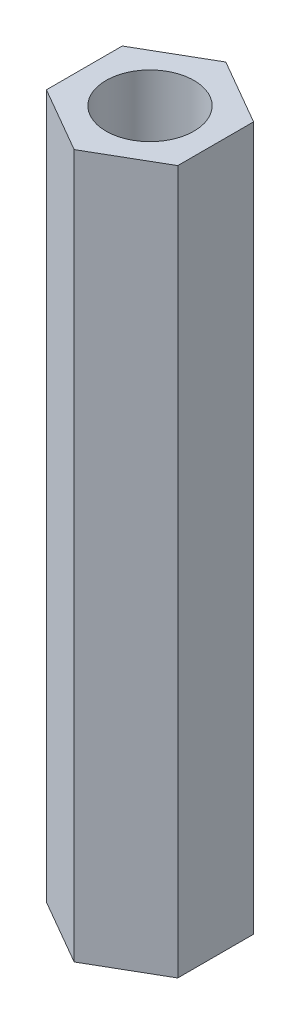
ISO-10303-21;
HEADER;
FILE_DESCRIPTION(('STEP AP214'),'2;1');
FILE_NAME('part.step','',(''),(''),'','','');
FILE_SCHEMA(('AUTOMOTIVE_DESIGN { 1 0 10303 214 1 1 1 1 }'));
ENDSEC;
DATA;
#1=APPLICATION_CONTEXT('core data for automotive mechanical design processes');
#2=APPLICATION_PROTOCOL_DEFINITION('international standard','automotive_design',2000,#1);
#3=PRODUCT_CONTEXT('',#1,'mechanical');
#4=PRODUCT('Part','Part','',(#3));
#5=PRODUCT_RELATED_PRODUCT_CATEGORY('part','',(#4));
#6=PRODUCT_DEFINITION_FORMATION('','',#4);
#7=PRODUCT_DEFINITION_CONTEXT('part definition',#1,'design');
#8=PRODUCT_DEFINITION('design','',#6,#7);
#9=PRODUCT_DEFINITION_SHAPE('','',#8);
#10=(LENGTH_UNIT() NAMED_UNIT(*) SI_UNIT(.MILLI.,.METRE.));
#11=(NAMED_UNIT(*) PLANE_ANGLE_UNIT() SI_UNIT($,.RADIAN.));
#12=(NAMED_UNIT(*) SI_UNIT($,.STERADIAN.) SOLID_ANGLE_UNIT());
#13=UNCERTAINTY_MEASURE_WITH_UNIT(LENGTH_MEASURE(1.E-05),#10,'distance_accuracy_value','');
#14=(GEOMETRIC_REPRESENTATION_CONTEXT(3) GLOBAL_UNCERTAINTY_ASSIGNED_CONTEXT((#13)) GLOBAL_UNIT_ASSIGNED_CONTEXT((#10,
#11,#12)) REPRESENTATION_CONTEXT('',''));
#15=CARTESIAN_POINT('',(0.,0.,0.));
#16=DIRECTION('',(0.,0.,1.));
#17=DIRECTION('',(1.,0.,0.));
#18=AXIS2_PLACEMENT_3D('',#15,#16,#17);
#19=CARTESIAN_POINT('',(0.,19.05,0.));
#20=DIRECTION('',(0.,1.,0.));
#21=DIRECTION('',(0.,0.,1.));
#22=AXIS2_PLACEMENT_3D('',#19,#20,#21);
#23=PLANE('',#22);
#24=DIRECTION('',(0.866025403784438,0.,0.5));
#25=VECTOR('',#24,1.);
#26=CARTESIAN_POINT('',(-1.778,19.05,1.02652877861915));
#27=LINE('',#26,#25);
#28=CARTESIAN_POINT('',(-1.778,19.05,1.02652877861915));
#29=VERTEX_POINT('',#28);
#30=CARTESIAN_POINT('',(0.,19.05,2.05305755723831));
#31=VERTEX_POINT('',#30);
#32=EDGE_CURVE('E128',#29,#31,#27,.T.);
#33=ORIENTED_EDGE('',*,*,#32,.T.);
#34=DIRECTION('',(0.866025403784439,0.,-0.5));
#35=VECTOR('',#34,1.);
#36=CARTESIAN_POINT('',(0.,19.05,2.05305755723831));
#37=LINE('',#36,#35);
#38=CARTESIAN_POINT('',(1.778,19.05,1.02652877861915));
#39=VERTEX_POINT('',#38);
#40=EDGE_CURVE('E86',#31,#39,#37,.T.);
#41=ORIENTED_EDGE('',*,*,#40,.T.);
#42=DIRECTION('',(0.,0.,-1.));
#43=VECTOR('',#42,1.);
#44=CARTESIAN_POINT('',(1.778,19.05,1.02652877861915));
#45=LINE('',#44,#43);
#46=CARTESIAN_POINT('',(1.778,19.05,-1.02652877861915));
#47=VERTEX_POINT('',#46);
#48=EDGE_CURVE('E99',#39,#47,#45,.T.);
#49=ORIENTED_EDGE('',*,*,#48,.T.);
#50=DIRECTION('',(-0.866025403784439,0.,-0.5));
#51=VECTOR('',#50,1.);
#52=CARTESIAN_POINT('',(1.778,19.05,-1.02652877861915));
#53=LINE('',#52,#51);
#54=CARTESIAN_POINT('',(0.,19.05,-2.05305755723831));
#55=VERTEX_POINT('',#54);
#56=EDGE_CURVE('E93',#47,#55,#53,.T.);
#57=ORIENTED_EDGE('',*,*,#56,.T.);
#58=DIRECTION('',(-0.866025403784439,0.,0.5));
#59=VECTOR('',#58,1.);
#60=CARTESIAN_POINT('',(0.,19.05,-2.05305755723831));
#61=LINE('',#60,#59);
#62=CARTESIAN_POINT('',(-1.778,19.05,-1.02652877861915));
#63=VERTEX_POINT('',#62);
#64=EDGE_CURVE('E97',#55,#63,#61,.T.);
#65=ORIENTED_EDGE('',*,*,#64,.T.);
#66=DIRECTION('',(0.,0.,1.));
#67=VECTOR('',#66,1.);
#68=CARTESIAN_POINT('',(-1.778,19.05,-1.02652877861915));
#69=LINE('',#68,#67);
#70=EDGE_CURVE('E49',#63,#29,#69,.T.);
#71=ORIENTED_EDGE('',*,*,#70,.T.);
#72=EDGE_LOOP('',(#33,#41,#49,#57,#65,#71));
#73=FACE_BOUND('',#72,.T.);
#74=CARTESIAN_POINT('',(0.,19.05,0.));
#75=DIRECTION('',(0.,1.,0.));
#76=DIRECTION('',(0.,0.,1.));
#77=AXIS2_PLACEMENT_3D('',#74,#75,#76);
#78=CIRCLE('',#77,1.190625);
#79=CARTESIAN_POINT('',(0.,19.05,1.190625));
#80=VERTEX_POINT('',#79);
#81=EDGE_CURVE('E121',#80,#80,#78,.T.);
#82=ORIENTED_EDGE('',*,*,#81,.F.);
#83=EDGE_LOOP('',(#82));
#84=FACE_BOUND('',#83,.T.);
#85=ADVANCED_FACE('F32',(#73,#84),#23,.T.);
#86=CARTESIAN_POINT('',(0.,0.,0.));
#87=DIRECTION('',(0.,1.,0.));
#88=DIRECTION('',(0.,0.,1.));
#89=AXIS2_PLACEMENT_3D('',#86,#87,#88);
#90=PLANE('',#89);
#91=DIRECTION('',(0.866025403784438,0.,0.5));
#92=VECTOR('',#91,1.);
#93=CARTESIAN_POINT('',(-1.778,0.,1.02652877861915));
#94=LINE('',#93,#92);
#95=CARTESIAN_POINT('',(-1.778,0.,1.02652877861915));
#96=VERTEX_POINT('',#95);
#97=CARTESIAN_POINT('',(0.,0.,2.05305755723831));
#98=VERTEX_POINT('',#97);
#99=EDGE_CURVE('E117',#96,#98,#94,.T.);
#100=ORIENTED_EDGE('',*,*,#99,.F.);
#101=DIRECTION('',(0.,0.,1.));
#102=VECTOR('',#101,1.);
#103=CARTESIAN_POINT('',(-1.778,0.,-1.02652877861915));
#104=LINE('',#103,#102);
#105=CARTESIAN_POINT('',(-1.778,0.,-1.02652877861915));
#106=VERTEX_POINT('',#105);
#107=EDGE_CURVE('E78',#106,#96,#104,.T.);
#108=ORIENTED_EDGE('',*,*,#107,.F.);
#109=DIRECTION('',(-0.866025403784439,0.,0.5));
#110=VECTOR('',#109,1.);
#111=CARTESIAN_POINT('',(0.,0.,-2.05305755723831));
#112=LINE('',#111,#110);
#113=CARTESIAN_POINT('',(0.,0.,-2.05305755723831));
#114=VERTEX_POINT('',#113);
#115=EDGE_CURVE('E72',#114,#106,#112,.T.);
#116=ORIENTED_EDGE('',*,*,#115,.F.);
#117=DIRECTION('',(-0.866025403784439,0.,-0.5));
#118=VECTOR('',#117,1.);
#119=CARTESIAN_POINT('',(1.778,0.,-1.02652877861915));
#120=LINE('',#119,#118);
#121=CARTESIAN_POINT('',(1.778,0.,-1.02652877861915));
#122=VERTEX_POINT('',#121);
#123=EDGE_CURVE('E107',#122,#114,#120,.T.);
#124=ORIENTED_EDGE('',*,*,#123,.F.);
#125=DIRECTION('',(0.,0.,-1.));
#126=VECTOR('',#125,1.);
#127=CARTESIAN_POINT('',(1.778,0.,1.02652877861915));
#128=LINE('',#127,#126);
#129=CARTESIAN_POINT('',(1.778,0.,1.02652877861915));
#130=VERTEX_POINT('',#129);
#131=EDGE_CURVE('E123',#130,#122,#128,.T.);
#132=ORIENTED_EDGE('',*,*,#131,.F.);
#133=DIRECTION('',(0.866025403784439,0.,-0.5));
#134=VECTOR('',#133,1.);
#135=CARTESIAN_POINT('',(0.,0.,2.05305755723831));
#136=LINE('',#135,#134);
#137=EDGE_CURVE('E120',#98,#130,#136,.T.);
#138=ORIENTED_EDGE('',*,*,#137,.F.);
#139=EDGE_LOOP('',(#100,#108,#116,#124,#132,#138));
#140=FACE_BOUND('',#139,.T.);
#141=CARTESIAN_POINT('',(0.,0.,0.));
#142=DIRECTION('',(0.,1.,0.));
#143=DIRECTION('',(0.,0.,1.));
#144=AXIS2_PLACEMENT_3D('',#141,#142,#143);
#145=CIRCLE('',#144,1.190625);
#146=CARTESIAN_POINT('',(0.,0.,1.190625));
#147=VERTEX_POINT('',#146);
#148=EDGE_CURVE('E221',#147,#147,#145,.T.);
#149=ORIENTED_EDGE('',*,*,#148,.T.);
#150=EDGE_LOOP('',(#149));
#151=FACE_BOUND('',#150,.T.);
#152=ADVANCED_FACE('F137',(#140,#151),#90,.F.);
#153=CARTESIAN_POINT('',(-1.778,19.05,1.02652877861915));
#154=DIRECTION('',(0.5,0.,-0.866025403784439));
#155=DIRECTION('',(-0.866025403784438,0.,-0.5));
#156=AXIS2_PLACEMENT_3D('',#153,#154,#155);
#157=PLANE('',#156);
#158=ORIENTED_EDGE('',*,*,#99,.T.);
#159=DIRECTION('',(0.,-1.,0.));
#160=VECTOR('',#159,1.);
#161=CARTESIAN_POINT('',(0.,19.05,2.05305755723831));
#162=LINE('',#161,#160);
#163=EDGE_CURVE('E11',#31,#98,#162,.T.);
#164=ORIENTED_EDGE('',*,*,#163,.F.);
#165=ORIENTED_EDGE('',*,*,#32,.F.);
#166=DIRECTION('',(0.,-1.,0.));
#167=VECTOR('',#166,1.);
#168=CARTESIAN_POINT('',(-1.778,19.05,1.02652877861915));
#169=LINE('',#168,#167);
#170=EDGE_CURVE('E113',#29,#96,#169,.T.);
#171=ORIENTED_EDGE('',*,*,#170,.T.);
#172=EDGE_LOOP('',(#158,#164,#165,#171));
#173=FACE_BOUND('',#172,.T.);
#174=ADVANCED_FACE('F34',(#173),#157,.F.);
#175=CARTESIAN_POINT('',(0.,19.05,2.05305755723831));
#176=DIRECTION('',(-0.5,0.,-0.866025403784439));
#177=DIRECTION('',(-0.866025403784439,0.,0.5));
#178=AXIS2_PLACEMENT_3D('',#175,#176,#177);
#179=PLANE('',#178);
#180=ORIENTED_EDGE('',*,*,#137,.T.);
#181=DIRECTION('',(0.,-1.,0.));
#182=VECTOR('',#181,1.);
#183=CARTESIAN_POINT('',(1.778,19.05,1.02652877861915));
#184=LINE('',#183,#182);
#185=EDGE_CURVE('E41',#39,#130,#184,.T.);
#186=ORIENTED_EDGE('',*,*,#185,.F.);
#187=ORIENTED_EDGE('',*,*,#40,.F.);
#188=ORIENTED_EDGE('',*,*,#163,.T.);
#189=EDGE_LOOP('',(#180,#186,#187,#188));
#190=FACE_BOUND('',#189,.T.);
#191=ADVANCED_FACE('F162',(#190),#179,.F.);
#192=CARTESIAN_POINT('',(1.778,19.05,1.02652877861915));
#193=DIRECTION('',(-1.,0.,0.));
#194=DIRECTION('',(0.,0.,1.));
#195=AXIS2_PLACEMENT_3D('',#192,#193,#194);
#196=PLANE('',#195);
#197=ORIENTED_EDGE('',*,*,#131,.T.);
#198=DIRECTION('',(0.,-1.,0.));
#199=VECTOR('',#198,1.);
#200=CARTESIAN_POINT('',(1.778,19.05,-1.02652877861915));
#201=LINE('',#200,#199);
#202=EDGE_CURVE('E108',#47,#122,#201,.T.);
#203=ORIENTED_EDGE('',*,*,#202,.F.);
#204=ORIENTED_EDGE('',*,*,#48,.F.);
#205=ORIENTED_EDGE('',*,*,#185,.T.);
#206=EDGE_LOOP('',(#197,#203,#204,#205));
#207=FACE_BOUND('',#206,.T.);
#208=ADVANCED_FACE('F134',(#207),#196,.F.);
#209=CARTESIAN_POINT('',(1.778,19.05,-1.02652877861915));
#210=DIRECTION('',(-0.5,0.,0.866025403784439));
#211=DIRECTION('',(0.866025403784438,0.,0.5));
#212=AXIS2_PLACEMENT_3D('',#209,#210,#211);
#213=PLANE('',#212);
#214=ORIENTED_EDGE('',*,*,#123,.T.);
#215=DIRECTION('',(0.,-1.,0.));
#216=VECTOR('',#215,1.);
#217=CARTESIAN_POINT('',(0.,19.05,-2.05305755723831));
#218=LINE('',#217,#216);
#219=EDGE_CURVE('E104',#55,#114,#218,.T.);
#220=ORIENTED_EDGE('',*,*,#219,.F.);
#221=ORIENTED_EDGE('',*,*,#56,.F.);
#222=ORIENTED_EDGE('',*,*,#202,.T.);
#223=EDGE_LOOP('',(#214,#220,#221,#222));
#224=FACE_BOUND('',#223,.T.);
#225=ADVANCED_FACE('F105',(#224),#213,.F.);
#226=CARTESIAN_POINT('',(0.,19.05,-2.05305755723831));
#227=DIRECTION('',(0.5,0.,0.866025403784439));
#228=DIRECTION('',(0.866025403784439,0.,-0.5));
#229=AXIS2_PLACEMENT_3D('',#226,#227,#228);
#230=PLANE('',#229);
#231=ORIENTED_EDGE('',*,*,#115,.T.);
#232=DIRECTION('',(0.,-1.,0.));
#233=VECTOR('',#232,1.);
#234=CARTESIAN_POINT('',(-1.778,19.05,-1.02652877861915));
#235=LINE('',#234,#233);
#236=EDGE_CURVE('E109',#63,#106,#235,.T.);
#237=ORIENTED_EDGE('',*,*,#236,.F.);
#238=ORIENTED_EDGE('',*,*,#64,.F.);
#239=ORIENTED_EDGE('',*,*,#219,.T.);
#240=EDGE_LOOP('',(#231,#237,#238,#239));
#241=FACE_BOUND('',#240,.T.);
#242=ADVANCED_FACE('F111',(#241),#230,.F.);
#243=CARTESIAN_POINT('',(-1.778,19.05,-1.02652877861915));
#244=DIRECTION('',(1.,0.,0.));
#245=DIRECTION('',(0.,0.,-1.));
#246=AXIS2_PLACEMENT_3D('',#243,#244,#245);
#247=PLANE('',#246);
#248=ORIENTED_EDGE('',*,*,#107,.T.);
#249=ORIENTED_EDGE('',*,*,#170,.F.);
#250=ORIENTED_EDGE('',*,*,#70,.F.);
#251=ORIENTED_EDGE('',*,*,#236,.T.);
#252=EDGE_LOOP('',(#248,#249,#250,#251));
#253=FACE_BOUND('',#252,.T.);
#254=ADVANCED_FACE('F142',(#253),#247,.F.);
#255=CARTESIAN_POINT('',(0.,19.05,0.));
#256=DIRECTION('',(0.,-1.,0.));
#257=DIRECTION('',(0.,0.,-1.));
#258=AXIS2_PLACEMENT_3D('',#255,#256,#257);
#259=CYLINDRICAL_SURFACE('',#258,1.190625);
#260=ORIENTED_EDGE('',*,*,#81,.T.);
#261=EDGE_LOOP('',(#260));
#262=FACE_BOUND('',#261,.T.);
#263=ORIENTED_EDGE('',*,*,#148,.F.);
#264=EDGE_LOOP('',(#263));
#265=FACE_BOUND('',#264,.T.);
#266=ADVANCED_FACE('F144',(#262,#265),#259,.F.);
#267=CLOSED_SHELL('',(#85,#152,#174,#191,#208,#225,#242,#254,#266));
#268=MANIFOLD_SOLID_BREP('B2',#267);
#269=ADVANCED_BREP_SHAPE_REPRESENTATION('',(#18,#268),#14);
#270=SHAPE_DEFINITION_REPRESENTATION(#9,#269);
ENDSEC;
END-ISO-10303-21;
